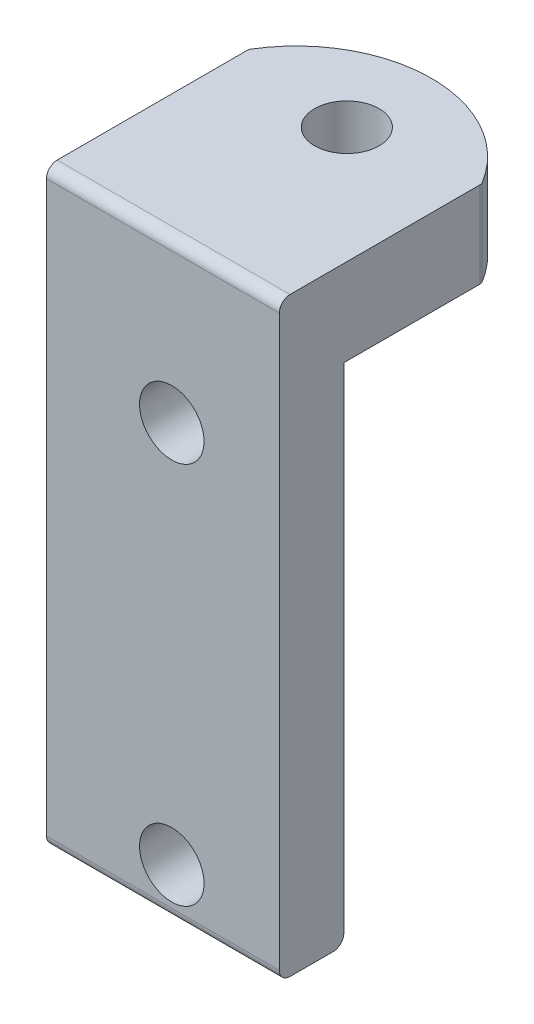
ISO-10303-21;
HEADER;
FILE_DESCRIPTION(('STEP AP214'),'2;1');
FILE_NAME('part.step','',(''),(''),'','','');
FILE_SCHEMA(('AUTOMOTIVE_DESIGN { 1 0 10303 214 1 1 1 1 }'));
ENDSEC;
DATA;
#1=APPLICATION_CONTEXT('core data for automotive mechanical design processes');
#2=APPLICATION_PROTOCOL_DEFINITION('international standard','automotive_design',2000,#1);
#3=PRODUCT_CONTEXT('',#1,'mechanical');
#4=PRODUCT('Part','Part','',(#3));
#5=PRODUCT_RELATED_PRODUCT_CATEGORY('part','',(#4));
#6=PRODUCT_DEFINITION_FORMATION('','',#4);
#7=PRODUCT_DEFINITION_CONTEXT('part definition',#1,'design');
#8=PRODUCT_DEFINITION('design','',#6,#7);
#9=PRODUCT_DEFINITION_SHAPE('','',#8);
#10=(LENGTH_UNIT() NAMED_UNIT(*) SI_UNIT(.MILLI.,.METRE.));
#11=(NAMED_UNIT(*) PLANE_ANGLE_UNIT() SI_UNIT($,.RADIAN.));
#12=(NAMED_UNIT(*) SI_UNIT($,.STERADIAN.) SOLID_ANGLE_UNIT());
#13=UNCERTAINTY_MEASURE_WITH_UNIT(LENGTH_MEASURE(1.E-05),#10,'distance_accuracy_value','');
#14=(GEOMETRIC_REPRESENTATION_CONTEXT(3) GLOBAL_UNCERTAINTY_ASSIGNED_CONTEXT((#13)) GLOBAL_UNIT_ASSIGNED_CONTEXT((#10,
#11,#12)) REPRESENTATION_CONTEXT('',''));
#15=CARTESIAN_POINT('',(0.,0.,0.));
#16=DIRECTION('',(0.,0.,1.));
#17=DIRECTION('',(1.,0.,0.));
#18=AXIS2_PLACEMENT_3D('',#15,#16,#17);
#19=CARTESIAN_POINT('',(13.2590424296117,37.5933432840566,-3.20424855422514));
#20=DIRECTION('',(0.,-1.,0.));
#21=DIRECTION('',(0.,0.,-1.));
#22=AXIS2_PLACEMENT_3D('',#19,#20,#21);
#23=PLANE('',#22);
#24=CARTESIAN_POINT('',(13.2590424296117,37.5933432840566,-5.55461385574141));
#25=DIRECTION('',(0.,1.,0.));
#26=DIRECTION('',(0.,0.,1.));
#27=AXIS2_PLACEMENT_3D('',#24,#25,#26);
#28=CIRCLE('',#27,1.5);
#29=CARTESIAN_POINT('',(13.2590424296117,37.5933432840566,-4.05461385574141));
#30=VERTEX_POINT('',#29);
#31=EDGE_CURVE('E274',#30,#30,#28,.T.);
#32=ORIENTED_EDGE('',*,*,#31,.F.);
#33=EDGE_LOOP('',(#32));
#34=FACE_BOUND('',#33,.T.);
#35=CARTESIAN_POINT('',(13.2590424296117,37.5933432840566,-3.20424855422514));
#36=DIRECTION('',(0.,1.,0.));
#37=DIRECTION('',(0.,0.,-1.));
#38=AXIS2_PLACEMENT_3D('',#35,#36,#37);
#39=CIRCLE('',#38,6.29123867116729);
#40=CARTESIAN_POINT('',(18.636844119722,37.5933432840566,-6.46905069209483));
#41=VERTEX_POINT('',#40);
#42=CARTESIAN_POINT('',(7.88124073950153,37.5933432840566,-6.46905069209483));
#43=VERTEX_POINT('',#42);
#44=EDGE_CURVE('E267',#41,#43,#39,.T.);
#45=ORIENTED_EDGE('',*,*,#44,.T.);
#46=CARTESIAN_POINT('',(8.09494276112235,37.5933432840566,-6.33931462943231));
#47=DIRECTION('',(0.,-1.,0.));
#48=DIRECTION('',(0.,0.,-1.));
#49=AXIS2_PLACEMENT_3D('',#46,#47,#48);
#50=CIRCLE('',#49,0.25);
#51=CARTESIAN_POINT('',(7.84494276112235,37.5933432840566,-6.33931462943231));
#52=VERTEX_POINT('',#51);
#53=EDGE_CURVE('E178',#43,#52,#50,.F.);
#54=ORIENTED_EDGE('',*,*,#53,.T.);
#55=DIRECTION('',(0.,0.,1.));
#56=VECTOR('',#55,1.);
#57=CARTESIAN_POINT('',(7.84494276112235,37.5933432840566,0.));
#58=LINE('',#57,#56);
#59=CARTESIAN_POINT('',(7.84494276112235,37.5933432840566,2.5));
#60=VERTEX_POINT('',#59);
#61=EDGE_CURVE('E262',#52,#60,#58,.T.);
#62=ORIENTED_EDGE('',*,*,#61,.T.);
#63=DIRECTION('',(1.,0.,0.));
#64=VECTOR('',#63,1.);
#65=CARTESIAN_POINT('',(13.2590424296117,37.5933432840566,2.5));
#66=LINE('',#65,#64);
#67=CARTESIAN_POINT('',(18.6731420981011,37.5933432840566,2.5));
#68=VERTEX_POINT('',#67);
#69=EDGE_CURVE('E153',#60,#68,#66,.T.);
#70=ORIENTED_EDGE('',*,*,#69,.T.);
#71=DIRECTION('',(0.,0.,-1.));
#72=VECTOR('',#71,1.);
#73=CARTESIAN_POINT('',(18.6731420981011,37.5933432840566,3.));
#74=LINE('',#73,#72);
#75=CARTESIAN_POINT('',(18.6731420981011,37.5933432840566,-6.33931462943231));
#76=VERTEX_POINT('',#75);
#77=EDGE_CURVE('E257',#68,#76,#74,.T.);
#78=ORIENTED_EDGE('',*,*,#77,.T.);
#79=CARTESIAN_POINT('',(18.4231420981011,37.5933432840566,-6.33931462943231));
#80=DIRECTION('',(0.,-1.,0.));
#81=DIRECTION('',(0.,0.,-1.));
#82=AXIS2_PLACEMENT_3D('',#79,#80,#81);
#83=CIRCLE('',#82,0.25);
#84=EDGE_CURVE('E166',#76,#41,#83,.F.);
#85=ORIENTED_EDGE('',*,*,#84,.T.);
#86=EDGE_LOOP('',(#45,#54,#62,#70,#78,#85));
#87=FACE_BOUND('',#86,.T.);
#88=ADVANCED_FACE('F33',(#34,#87),#23,.F.);
#89=CARTESIAN_POINT('',(13.2590424296117,33.5933432840566,-3.20424855422514));
#90=DIRECTION('',(0.,-1.,0.));
#91=DIRECTION('',(0.,0.,-1.));
#92=AXIS2_PLACEMENT_3D('',#89,#90,#91);
#93=PLANE('',#92);
#94=CARTESIAN_POINT('',(13.2590424296117,33.5933432840566,-5.55461385574141));
#95=DIRECTION('',(0.,1.,0.));
#96=DIRECTION('',(0.,0.,1.));
#97=AXIS2_PLACEMENT_3D('',#94,#95,#96);
#98=CIRCLE('',#97,1.5);
#99=CARTESIAN_POINT('',(13.2590424296117,33.5933432840566,-4.05461385574141));
#100=VERTEX_POINT('',#99);
#101=EDGE_CURVE('E293',#100,#100,#98,.T.);
#102=ORIENTED_EDGE('',*,*,#101,.T.);
#103=EDGE_LOOP('',(#102));
#104=FACE_BOUND('',#103,.T.);
#105=DIRECTION('',(0.,0.,-1.));
#106=VECTOR('',#105,1.);
#107=CARTESIAN_POINT('',(7.84494276112235,33.5933432840566,-3.20424855422514));
#108=LINE('',#107,#106);
#109=CARTESIAN_POINT('',(7.84494276112235,33.5933432840566,0.));
#110=VERTEX_POINT('',#109);
#111=CARTESIAN_POINT('',(7.84494276112235,33.5933432840566,-6.33931462943231));
#112=VERTEX_POINT('',#111);
#113=EDGE_CURVE('E138',#110,#112,#108,.T.);
#114=ORIENTED_EDGE('',*,*,#113,.T.);
#115=CARTESIAN_POINT('',(8.09494276112235,33.5933432840566,-6.33931462943231));
#116=DIRECTION('',(0.,-1.,0.));
#117=DIRECTION('',(0.,0.,-1.));
#118=AXIS2_PLACEMENT_3D('',#115,#116,#117);
#119=CIRCLE('',#118,0.25);
#120=CARTESIAN_POINT('',(7.88124073950153,33.5933432840566,-6.46905069209483));
#121=VERTEX_POINT('',#120);
#122=EDGE_CURVE('E174',#112,#121,#119,.T.);
#123=ORIENTED_EDGE('',*,*,#122,.T.);
#124=CARTESIAN_POINT('',(13.2590424296117,33.5933432840566,-3.20424855422514));
#125=DIRECTION('',(0.,1.,0.));
#126=DIRECTION('',(0.,0.,-1.));
#127=AXIS2_PLACEMENT_3D('',#124,#125,#126);
#128=CIRCLE('',#127,6.29123867116729);
#129=CARTESIAN_POINT('',(18.636844119722,33.5933432840566,-6.46905069209483));
#130=VERTEX_POINT('',#129);
#131=EDGE_CURVE('E271',#130,#121,#128,.T.);
#132=ORIENTED_EDGE('',*,*,#131,.F.);
#133=CARTESIAN_POINT('',(18.4231420981011,33.5933432840566,-6.33931462943231));
#134=DIRECTION('',(0.,-1.,0.));
#135=DIRECTION('',(0.,0.,-1.));
#136=AXIS2_PLACEMENT_3D('',#133,#134,#135);
#137=CIRCLE('',#136,0.25);
#138=CARTESIAN_POINT('',(18.6731420981011,33.5933432840566,-6.33931462943231));
#139=VERTEX_POINT('',#138);
#140=EDGE_CURVE('E137',#130,#139,#137,.T.);
#141=ORIENTED_EDGE('',*,*,#140,.T.);
#142=DIRECTION('',(0.,0.,1.));
#143=VECTOR('',#142,1.);
#144=CARTESIAN_POINT('',(18.6731420981011,33.5933432840566,-3.20424855422514));
#145=LINE('',#144,#143);
#146=CARTESIAN_POINT('',(18.6731420981011,33.5933432840566,0.));
#147=VERTEX_POINT('',#146);
#148=EDGE_CURVE('E124',#139,#147,#145,.T.);
#149=ORIENTED_EDGE('',*,*,#148,.T.);
#150=DIRECTION('',(-1.,0.,0.));
#151=VECTOR('',#150,1.);
#152=CARTESIAN_POINT('',(18.6731420981011,33.5933432840566,0.));
#153=LINE('',#152,#151);
#154=EDGE_CURVE('E128',#147,#110,#153,.T.);
#155=ORIENTED_EDGE('',*,*,#154,.T.);
#156=EDGE_LOOP('',(#114,#123,#132,#141,#149,#155));
#157=FACE_BOUND('',#156,.T.);
#158=ADVANCED_FACE('F134',(#104,#157),#93,.T.);
#159=CARTESIAN_POINT('',(13.2590424296117,37.5933432840566,-3.20424855422514));
#160=DIRECTION('',(0.,-1.,0.));
#161=DIRECTION('',(0.,0.,-1.));
#162=AXIS2_PLACEMENT_3D('',#159,#160,#161);
#163=CYLINDRICAL_SURFACE('',#162,6.29123867116729);
#164=ORIENTED_EDGE('',*,*,#131,.T.);
#165=DIRECTION('',(0.,-1.,0.));
#166=VECTOR('',#165,1.);
#167=CARTESIAN_POINT('',(7.88124073950153,37.5933432840566,-6.46905069209483));
#168=LINE('',#167,#166);
#169=EDGE_CURVE('E176',#121,#43,#168,.F.);
#170=ORIENTED_EDGE('',*,*,#169,.T.);
#171=ORIENTED_EDGE('',*,*,#44,.F.);
#172=DIRECTION('',(0.,-1.,0.));
#173=VECTOR('',#172,1.);
#174=CARTESIAN_POINT('',(18.636844119722,37.5933432840566,-6.46905069209483));
#175=LINE('',#174,#173);
#176=EDGE_CURVE('E168',#41,#130,#175,.T.);
#177=ORIENTED_EDGE('',*,*,#176,.T.);
#178=EDGE_LOOP('',(#164,#170,#171,#177));
#179=FACE_BOUND('',#178,.T.);
#180=ADVANCED_FACE('F214',(#179),#163,.T.);
#181=CARTESIAN_POINT('',(0.,0.,3.));
#182=DIRECTION('',(0.,0.,-1.));
#183=DIRECTION('',(-1.,0.,0.));
#184=AXIS2_PLACEMENT_3D('',#181,#182,#183);
#185=PLANE('',#184);
#186=DIRECTION('',(0.,-1.,0.));
#187=VECTOR('',#186,1.);
#188=CARTESIAN_POINT('',(7.84494276112235,33.5933432840566,3.));
#189=LINE('',#188,#187);
#190=CARTESIAN_POINT('',(7.84494276112235,37.0933432840566,3.));
#191=VERTEX_POINT('',#190);
#192=CARTESIAN_POINT('',(7.84494276112235,10.6250597118897,3.));
#193=VERTEX_POINT('',#192);
#194=EDGE_CURVE('E142',#191,#193,#189,.T.);
#195=ORIENTED_EDGE('',*,*,#194,.T.);
#196=DIRECTION('',(1.,0.,0.));
#197=VECTOR('',#196,1.);
#198=CARTESIAN_POINT('',(0.,10.6250597118897,3.));
#199=LINE('',#198,#197);
#200=CARTESIAN_POINT('',(18.6731420981011,10.6250597118897,3.));
#201=VERTEX_POINT('',#200);
#202=EDGE_CURVE('E11',#193,#201,#199,.T.);
#203=ORIENTED_EDGE('',*,*,#202,.T.);
#204=DIRECTION('',(0.,1.,0.));
#205=VECTOR('',#204,1.);
#206=CARTESIAN_POINT('',(18.6731420981011,10.1250597118897,3.));
#207=LINE('',#206,#205);
#208=CARTESIAN_POINT('',(18.6731420981011,37.0933432840566,3.));
#209=VERTEX_POINT('',#208);
#210=EDGE_CURVE('E144',#201,#209,#207,.T.);
#211=ORIENTED_EDGE('',*,*,#210,.T.);
#212=DIRECTION('',(1.,0.,0.));
#213=VECTOR('',#212,1.);
#214=CARTESIAN_POINT('',(0.,37.0933432840566,3.));
#215=LINE('',#214,#213);
#216=EDGE_CURVE('E159',#209,#191,#215,.F.);
#217=ORIENTED_EDGE('',*,*,#216,.T.);
#218=EDGE_LOOP('',(#195,#203,#211,#217));
#219=FACE_BOUND('',#218,.T.);
#220=CARTESIAN_POINT('',(13.6731420981011,30.1750597118897,3.));
#221=DIRECTION('',(0.,0.,1.));
#222=DIRECTION('',(1.,0.,0.));
#223=AXIS2_PLACEMENT_3D('',#220,#221,#222);
#224=CIRCLE('',#223,1.5);
#225=CARTESIAN_POINT('',(15.1731420981011,30.1750597118897,3.));
#226=VERTEX_POINT('',#225);
#227=EDGE_CURVE('E278',#226,#226,#224,.T.);
#228=ORIENTED_EDGE('',*,*,#227,.F.);
#229=EDGE_LOOP('',(#228));
#230=FACE_BOUND('',#229,.T.);
#231=CARTESIAN_POINT('',(13.6731420981011,12.3750597118897,3.));
#232=DIRECTION('',(0.,0.,1.));
#233=DIRECTION('',(1.,0.,0.));
#234=AXIS2_PLACEMENT_3D('',#231,#232,#233);
#235=CIRCLE('',#234,1.5);
#236=CARTESIAN_POINT('',(15.1731420981011,12.3750597118897,3.));
#237=VERTEX_POINT('',#236);
#238=EDGE_CURVE('E265',#237,#237,#235,.T.);
#239=ORIENTED_EDGE('',*,*,#238,.F.);
#240=EDGE_LOOP('',(#239));
#241=FACE_BOUND('',#240,.T.);
#242=ADVANCED_FACE('F224',(#219,#230,#241),#185,.F.);
#243=CARTESIAN_POINT('',(0.,0.,0.));
#244=DIRECTION('',(0.,0.,-1.));
#245=DIRECTION('',(-1.,0.,0.));
#246=AXIS2_PLACEMENT_3D('',#243,#244,#245);
#247=PLANE('',#246);
#248=CARTESIAN_POINT('',(13.6731420981011,30.1750597118897,0.));
#249=DIRECTION('',(0.,0.,1.));
#250=DIRECTION('',(1.,0.,0.));
#251=AXIS2_PLACEMENT_3D('',#248,#249,#250);
#252=CIRCLE('',#251,1.5);
#253=CARTESIAN_POINT('',(15.1731420981011,30.1750597118897,0.));
#254=VERTEX_POINT('',#253);
#255=EDGE_CURVE('E276',#254,#254,#252,.T.);
#256=ORIENTED_EDGE('',*,*,#255,.T.);
#257=EDGE_LOOP('',(#256));
#258=FACE_BOUND('',#257,.T.);
#259=DIRECTION('',(0.,1.,0.));
#260=VECTOR('',#259,1.);
#261=CARTESIAN_POINT('',(18.6731420981011,27.4558768099763,0.));
#262=LINE('',#261,#260);
#263=CARTESIAN_POINT('',(18.6731420981011,10.6250597118897,0.));
#264=VERTEX_POINT('',#263);
#265=EDGE_CURVE('E119',#264,#147,#262,.T.);
#266=ORIENTED_EDGE('',*,*,#265,.F.);
#267=DIRECTION('',(1.,0.,0.));
#268=VECTOR('',#267,1.);
#269=CARTESIAN_POINT('',(7.84494276112235,10.6250597118897,0.));
#270=LINE('',#269,#268);
#271=CARTESIAN_POINT('',(7.84494276112235,10.6250597118897,0.));
#272=VERTEX_POINT('',#271);
#273=EDGE_CURVE('E56',#264,#272,#270,.F.);
#274=ORIENTED_EDGE('',*,*,#273,.T.);
#275=DIRECTION('',(0.,-1.,0.));
#276=VECTOR('',#275,1.);
#277=CARTESIAN_POINT('',(7.84494276112235,33.5933432840566,0.));
#278=LINE('',#277,#276);
#279=EDGE_CURVE('E129',#110,#272,#278,.T.);
#280=ORIENTED_EDGE('',*,*,#279,.F.);
#281=ORIENTED_EDGE('',*,*,#154,.F.);
#282=EDGE_LOOP('',(#266,#274,#280,#281));
#283=FACE_BOUND('',#282,.T.);
#284=CARTESIAN_POINT('',(13.6731420981011,12.3750597118897,0.));
#285=DIRECTION('',(0.,0.,1.));
#286=DIRECTION('',(1.,0.,0.));
#287=AXIS2_PLACEMENT_3D('',#284,#285,#286);
#288=CIRCLE('',#287,1.5);
#289=CARTESIAN_POINT('',(15.1731420981011,12.3750597118897,0.));
#290=VERTEX_POINT('',#289);
#291=EDGE_CURVE('E261',#290,#290,#288,.T.);
#292=ORIENTED_EDGE('',*,*,#291,.T.);
#293=EDGE_LOOP('',(#292));
#294=FACE_BOUND('',#293,.T.);
#295=ADVANCED_FACE('F140',(#258,#283,#294),#247,.T.);
#296=CARTESIAN_POINT('',(7.84494276112235,33.5933432840566,3.));
#297=DIRECTION('',(1.,0.,0.));
#298=DIRECTION('',(0.,0.,-1.));
#299=AXIS2_PLACEMENT_3D('',#296,#297,#298);
#300=PLANE('',#299);
#301=ORIENTED_EDGE('',*,*,#279,.T.);
#302=CARTESIAN_POINT('',(7.84494276112235,10.6250597118897,0.5));
#303=DIRECTION('',(1.,0.,0.));
#304=DIRECTION('',(0.,0.,-1.));
#305=AXIS2_PLACEMENT_3D('',#302,#303,#304);
#306=CIRCLE('',#305,0.5);
#307=CARTESIAN_POINT('',(7.84494276112235,10.1250597118897,0.5));
#308=VERTEX_POINT('',#307);
#309=EDGE_CURVE('E41',#272,#308,#306,.F.);
#310=ORIENTED_EDGE('',*,*,#309,.T.);
#311=DIRECTION('',(0.,0.,-1.));
#312=VECTOR('',#311,1.);
#313=CARTESIAN_POINT('',(7.84494276112235,10.1250597118897,3.));
#314=LINE('',#313,#312);
#315=CARTESIAN_POINT('',(7.84494276112235,10.1250597118897,2.5));
#316=VERTEX_POINT('',#315);
#317=EDGE_CURVE('E150',#316,#308,#314,.T.);
#318=ORIENTED_EDGE('',*,*,#317,.F.);
#319=CARTESIAN_POINT('',(7.84494276112235,10.6250597118897,2.5));
#320=DIRECTION('',(1.,0.,0.));
#321=DIRECTION('',(0.,0.,-1.));
#322=AXIS2_PLACEMENT_3D('',#319,#320,#321);
#323=CIRCLE('',#322,0.5);
#324=EDGE_CURVE('E48',#316,#193,#323,.F.);
#325=ORIENTED_EDGE('',*,*,#324,.T.);
#326=ORIENTED_EDGE('',*,*,#194,.F.);
#327=CARTESIAN_POINT('',(7.84494276112235,37.0933432840566,2.5));
#328=DIRECTION('',(1.,0.,0.));
#329=DIRECTION('',(0.,0.,-1.));
#330=AXIS2_PLACEMENT_3D('',#327,#328,#329);
#331=CIRCLE('',#330,0.5);
#332=EDGE_CURVE('E161',#191,#60,#331,.F.);
#333=ORIENTED_EDGE('',*,*,#332,.T.);
#334=ORIENTED_EDGE('',*,*,#61,.F.);
#335=DIRECTION('',(0.,-1.,0.));
#336=VECTOR('',#335,1.);
#337=CARTESIAN_POINT('',(7.84494276112235,33.5933432840566,-6.33931462943231));
#338=LINE('',#337,#336);
#339=EDGE_CURVE('E171',#52,#112,#338,.T.);
#340=ORIENTED_EDGE('',*,*,#339,.T.);
#341=ORIENTED_EDGE('',*,*,#113,.F.);
#342=EDGE_LOOP('',(#301,#310,#318,#325,#326,#333,#334,#340,#341));
#343=FACE_BOUND('',#342,.T.);
#344=ADVANCED_FACE('F190',(#343),#300,.F.);
#345=CARTESIAN_POINT('',(18.6731420981011,10.1250597118897,3.));
#346=DIRECTION('',(0.,1.,0.));
#347=DIRECTION('',(0.,0.,1.));
#348=AXIS2_PLACEMENT_3D('',#345,#346,#347);
#349=PLANE('',#348);
#350=ORIENTED_EDGE('',*,*,#317,.T.);
#351=DIRECTION('',(1.,0.,0.));
#352=VECTOR('',#351,1.);
#353=CARTESIAN_POINT('',(18.6731420981011,10.1250597118897,0.5));
#354=LINE('',#353,#352);
#355=CARTESIAN_POINT('',(18.6731420981011,10.1250597118897,0.5));
#356=VERTEX_POINT('',#355);
#357=EDGE_CURVE('E182',#308,#356,#354,.T.);
#358=ORIENTED_EDGE('',*,*,#357,.T.);
#359=DIRECTION('',(0.,0.,-1.));
#360=VECTOR('',#359,1.);
#361=CARTESIAN_POINT('',(18.6731420981011,10.1250597118897,3.));
#362=LINE('',#361,#360);
#363=CARTESIAN_POINT('',(18.6731420981011,10.1250597118897,2.5));
#364=VERTEX_POINT('',#363);
#365=EDGE_CURVE('E148',#364,#356,#362,.T.);
#366=ORIENTED_EDGE('',*,*,#365,.F.);
#367=DIRECTION('',(1.,0.,0.));
#368=VECTOR('',#367,1.);
#369=CARTESIAN_POINT('',(18.6731420981011,10.1250597118897,2.5));
#370=LINE('',#369,#368);
#371=EDGE_CURVE('E180',#364,#316,#370,.F.);
#372=ORIENTED_EDGE('',*,*,#371,.T.);
#373=EDGE_LOOP('',(#350,#358,#366,#372));
#374=FACE_BOUND('',#373,.T.);
#375=ADVANCED_FACE('F194',(#374),#349,.F.);
#376=CARTESIAN_POINT('',(18.6731420981011,27.4558768099763,3.));
#377=DIRECTION('',(-1.,0.,0.));
#378=DIRECTION('',(0.,0.,1.));
#379=AXIS2_PLACEMENT_3D('',#376,#377,#378);
#380=PLANE('',#379);
#381=ORIENTED_EDGE('',*,*,#365,.T.);
#382=CARTESIAN_POINT('',(18.6731420981011,10.6250597118897,0.5));
#383=DIRECTION('',(-1.,0.,0.));
#384=DIRECTION('',(0.,0.,1.));
#385=AXIS2_PLACEMENT_3D('',#382,#383,#384);
#386=CIRCLE('',#385,0.5);
#387=EDGE_CURVE('E126',#356,#264,#386,.F.);
#388=ORIENTED_EDGE('',*,*,#387,.T.);
#389=ORIENTED_EDGE('',*,*,#265,.T.);
#390=ORIENTED_EDGE('',*,*,#148,.F.);
#391=DIRECTION('',(0.,-1.,0.));
#392=VECTOR('',#391,1.);
#393=CARTESIAN_POINT('',(18.6731420981011,27.4558768099763,-6.33931462943231));
#394=LINE('',#393,#392);
#395=EDGE_CURVE('E164',#139,#76,#394,.F.);
#396=ORIENTED_EDGE('',*,*,#395,.T.);
#397=ORIENTED_EDGE('',*,*,#77,.F.);
#398=CARTESIAN_POINT('',(18.6731420981011,37.0933432840566,2.5));
#399=DIRECTION('',(-1.,0.,0.));
#400=DIRECTION('',(0.,0.,1.));
#401=AXIS2_PLACEMENT_3D('',#398,#399,#400);
#402=CIRCLE('',#401,0.5);
#403=EDGE_CURVE('E156',#68,#209,#402,.F.);
#404=ORIENTED_EDGE('',*,*,#403,.T.);
#405=ORIENTED_EDGE('',*,*,#210,.F.);
#406=CARTESIAN_POINT('',(18.6731420981011,10.6250597118897,2.5));
#407=DIRECTION('',(-1.,0.,0.));
#408=DIRECTION('',(0.,0.,1.));
#409=AXIS2_PLACEMENT_3D('',#406,#407,#408);
#410=CIRCLE('',#409,0.5);
#411=EDGE_CURVE('E185',#201,#364,#410,.F.);
#412=ORIENTED_EDGE('',*,*,#411,.T.);
#413=EDGE_LOOP('',(#381,#388,#389,#390,#396,#397,#404,#405,#412));
#414=FACE_BOUND('',#413,.T.);
#415=ADVANCED_FACE('F122',(#414),#380,.F.);
#416=CARTESIAN_POINT('',(13.6731420981011,30.1750597118897,3.));
#417=DIRECTION('',(0.,0.,-1.));
#418=DIRECTION('',(-1.,0.,0.));
#419=AXIS2_PLACEMENT_3D('',#416,#417,#418);
#420=CYLINDRICAL_SURFACE('',#419,1.5);
#421=ORIENTED_EDGE('',*,*,#227,.T.);
#422=EDGE_LOOP('',(#421));
#423=FACE_BOUND('',#422,.T.);
#424=ORIENTED_EDGE('',*,*,#255,.F.);
#425=EDGE_LOOP('',(#424));
#426=FACE_BOUND('',#425,.T.);
#427=ADVANCED_FACE('F229',(#423,#426),#420,.F.);
#428=CARTESIAN_POINT('',(13.6731420981011,12.3750597118897,3.));
#429=DIRECTION('',(0.,0.,-1.));
#430=DIRECTION('',(-1.,0.,0.));
#431=AXIS2_PLACEMENT_3D('',#428,#429,#430);
#432=CYLINDRICAL_SURFACE('',#431,1.5);
#433=ORIENTED_EDGE('',*,*,#238,.T.);
#434=EDGE_LOOP('',(#433));
#435=FACE_BOUND('',#434,.T.);
#436=ORIENTED_EDGE('',*,*,#291,.F.);
#437=EDGE_LOOP('',(#436));
#438=FACE_BOUND('',#437,.T.);
#439=ADVANCED_FACE('F226',(#435,#438),#432,.F.);
#440=CARTESIAN_POINT('',(13.2590424296117,37.5933432840566,-5.55461385574141));
#441=DIRECTION('',(0.,-1.,0.));
#442=DIRECTION('',(0.,0.,-1.));
#443=AXIS2_PLACEMENT_3D('',#440,#441,#442);
#444=CYLINDRICAL_SURFACE('',#443,1.5);
#445=ORIENTED_EDGE('',*,*,#31,.T.);
#446=EDGE_LOOP('',(#445));
#447=FACE_BOUND('',#446,.T.);
#448=ORIENTED_EDGE('',*,*,#101,.F.);
#449=EDGE_LOOP('',(#448));
#450=FACE_BOUND('',#449,.T.);
#451=ADVANCED_FACE('F220',(#447,#450),#444,.F.);
#452=CARTESIAN_POINT('',(13.2590424296117,37.0933432840566,2.5));
#453=DIRECTION('',(1.,0.,0.));
#454=DIRECTION('',(0.,0.,-1.));
#455=AXIS2_PLACEMENT_3D('',#452,#453,#454);
#456=CYLINDRICAL_SURFACE('',#455,0.5);
#457=ORIENTED_EDGE('',*,*,#332,.F.);
#458=ORIENTED_EDGE('',*,*,#216,.F.);
#459=ORIENTED_EDGE('',*,*,#403,.F.);
#460=ORIENTED_EDGE('',*,*,#69,.F.);
#461=EDGE_LOOP('',(#457,#458,#459,#460));
#462=FACE_BOUND('',#461,.T.);
#463=ADVANCED_FACE('F246',(#462),#456,.T.);
#464=CARTESIAN_POINT('',(18.4231420981011,37.5933432840566,-6.33931462943231));
#465=DIRECTION('',(0.,-1.,0.));
#466=DIRECTION('',(0.,0.,-1.));
#467=AXIS2_PLACEMENT_3D('',#464,#465,#466);
#468=CYLINDRICAL_SURFACE('',#467,0.25);
#469=ORIENTED_EDGE('',*,*,#140,.F.);
#470=ORIENTED_EDGE('',*,*,#176,.F.);
#471=ORIENTED_EDGE('',*,*,#84,.F.);
#472=ORIENTED_EDGE('',*,*,#395,.F.);
#473=EDGE_LOOP('',(#469,#470,#471,#472));
#474=FACE_BOUND('',#473,.T.);
#475=ADVANCED_FACE('F205',(#474),#468,.T.);
#476=CARTESIAN_POINT('',(8.09494276112235,37.5933432840566,-6.33931462943231));
#477=DIRECTION('',(0.,-1.,0.));
#478=DIRECTION('',(0.,0.,-1.));
#479=AXIS2_PLACEMENT_3D('',#476,#477,#478);
#480=CYLINDRICAL_SURFACE('',#479,0.25);
#481=ORIENTED_EDGE('',*,*,#53,.F.);
#482=ORIENTED_EDGE('',*,*,#169,.F.);
#483=ORIENTED_EDGE('',*,*,#122,.F.);
#484=ORIENTED_EDGE('',*,*,#339,.F.);
#485=EDGE_LOOP('',(#481,#482,#483,#484));
#486=FACE_BOUND('',#485,.T.);
#487=ADVANCED_FACE('F199',(#486),#480,.T.);
#488=CARTESIAN_POINT('',(18.6731420981011,10.6250597118897,0.5));
#489=DIRECTION('',(-1.,0.,0.));
#490=DIRECTION('',(0.,0.,1.));
#491=AXIS2_PLACEMENT_3D('',#488,#489,#490);
#492=CYLINDRICAL_SURFACE('',#491,0.5);
#493=ORIENTED_EDGE('',*,*,#309,.F.);
#494=ORIENTED_EDGE('',*,*,#273,.F.);
#495=ORIENTED_EDGE('',*,*,#387,.F.);
#496=ORIENTED_EDGE('',*,*,#357,.F.);
#497=EDGE_LOOP('',(#493,#494,#495,#496));
#498=FACE_BOUND('',#497,.T.);
#499=ADVANCED_FACE('F197',(#498),#492,.T.);
#500=CARTESIAN_POINT('',(0.,10.6250597118897,2.5));
#501=DIRECTION('',(1.,0.,0.));
#502=DIRECTION('',(0.,0.,-1.));
#503=AXIS2_PLACEMENT_3D('',#500,#501,#502);
#504=CYLINDRICAL_SURFACE('',#503,0.5);
#505=ORIENTED_EDGE('',*,*,#324,.F.);
#506=ORIENTED_EDGE('',*,*,#371,.F.);
#507=ORIENTED_EDGE('',*,*,#411,.F.);
#508=ORIENTED_EDGE('',*,*,#202,.F.);
#509=EDGE_LOOP('',(#505,#506,#507,#508));
#510=FACE_BOUND('',#509,.T.);
#511=ADVANCED_FACE('F35',(#510),#504,.T.);
#512=CLOSED_SHELL('',(#88,#158,#180,#242,#295,#344,#375,#415,#427,#439,#451,#463,#475,#487,#499,#511));
#513=MANIFOLD_SOLID_BREP('B2',#512);
#514=ADVANCED_BREP_SHAPE_REPRESENTATION('',(#18,#513),#14);
#515=SHAPE_DEFINITION_REPRESENTATION(#9,#514);
ENDSEC;
END-ISO-10303-21;
